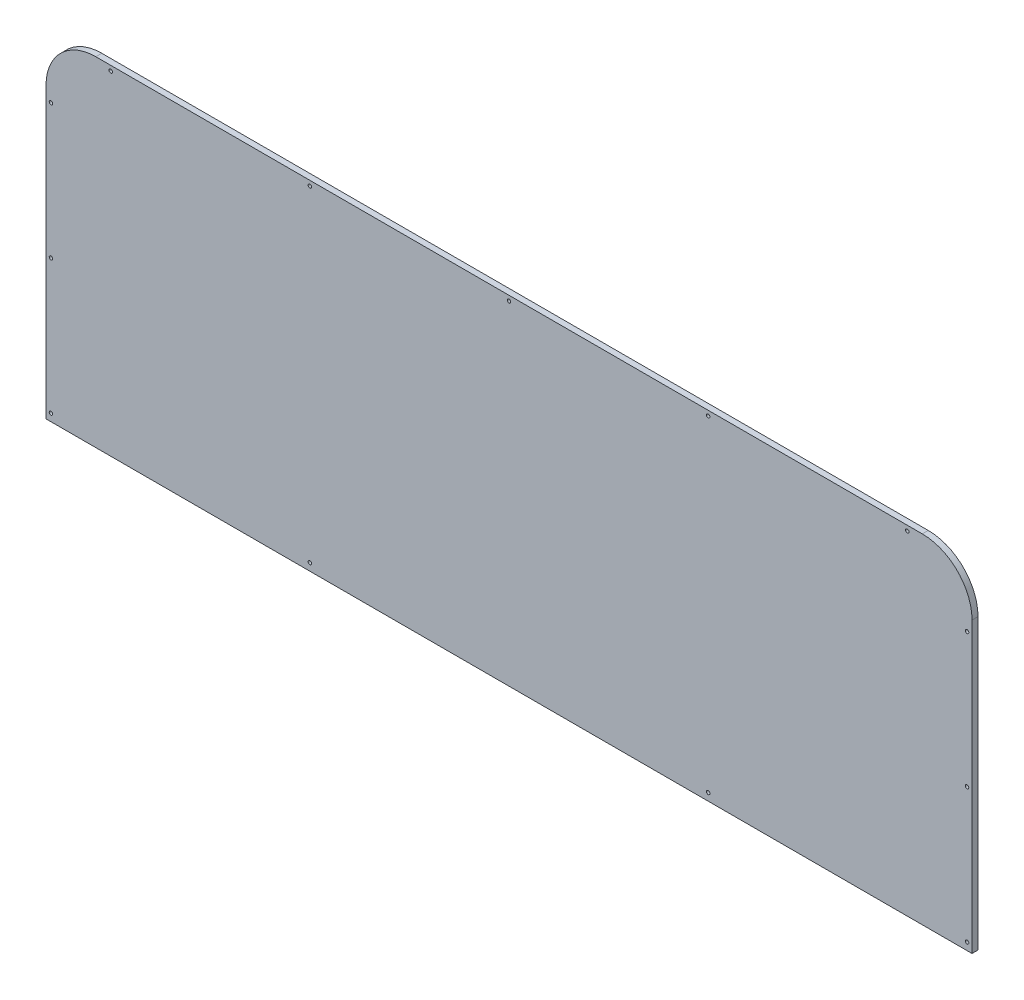
ISO-10303-21;
HEADER;
FILE_DESCRIPTION(('STEP AP214'),'2;1');
FILE_NAME('part.step','',(''),(''),'','','');
FILE_SCHEMA(('AUTOMOTIVE_DESIGN { 1 0 10303 214 1 1 1 1 }'));
ENDSEC;
DATA;
#1=APPLICATION_CONTEXT('core data for automotive mechanical design processes');
#2=APPLICATION_PROTOCOL_DEFINITION('international standard','automotive_design',2000,#1);
#3=PRODUCT_CONTEXT('',#1,'mechanical');
#4=PRODUCT('Part','Part','',(#3));
#5=PRODUCT_RELATED_PRODUCT_CATEGORY('part','',(#4));
#6=PRODUCT_DEFINITION_FORMATION('','',#4);
#7=PRODUCT_DEFINITION_CONTEXT('part definition',#1,'design');
#8=PRODUCT_DEFINITION('design','',#6,#7);
#9=PRODUCT_DEFINITION_SHAPE('','',#8);
#10=(LENGTH_UNIT() NAMED_UNIT(*) SI_UNIT(.MILLI.,.METRE.));
#11=(NAMED_UNIT(*) PLANE_ANGLE_UNIT() SI_UNIT($,.RADIAN.));
#12=(NAMED_UNIT(*) SI_UNIT($,.STERADIAN.) SOLID_ANGLE_UNIT());
#13=UNCERTAINTY_MEASURE_WITH_UNIT(LENGTH_MEASURE(1.E-05),#10,'distance_accuracy_value','');
#14=(GEOMETRIC_REPRESENTATION_CONTEXT(3) GLOBAL_UNCERTAINTY_ASSIGNED_CONTEXT((#13)) GLOBAL_UNIT_ASSIGNED_CONTEXT((#10,
#11,#12)) REPRESENTATION_CONTEXT('',''));
#15=CARTESIAN_POINT('',(0.,0.,0.));
#16=DIRECTION('',(0.,0.,1.));
#17=DIRECTION('',(1.,0.,0.));
#18=AXIS2_PLACEMENT_3D('',#15,#16,#17);
#19=CARTESIAN_POINT('',(830.,580.,-78.));
#20=DIRECTION('',(0.,0.,1.));
#21=DIRECTION('',(1.,0.,0.));
#22=AXIS2_PLACEMENT_3D('',#19,#20,#21);
#23=CYLINDRICAL_SURFACE('',#22,100.);
#24=CARTESIAN_POINT('',(830.,580.,-66.));
#25=DIRECTION('',(0.,0.,1.));
#26=DIRECTION('',(1.,0.,0.));
#27=AXIS2_PLACEMENT_3D('',#24,#25,#26);
#28=CIRCLE('',#27,100.);
#29=CARTESIAN_POINT('',(930.,579.999999999999,-66.));
#30=VERTEX_POINT('',#29);
#31=CARTESIAN_POINT('',(829.999999999999,680.,-66.));
#32=VERTEX_POINT('',#31);
#33=EDGE_CURVE('E120',#30,#32,#28,.T.);
#34=ORIENTED_EDGE('',*,*,#33,.F.);
#35=DIRECTION('',(0.,0.,1.));
#36=VECTOR('',#35,1.);
#37=CARTESIAN_POINT('',(930.,579.999999999999,-78.));
#38=LINE('',#37,#36);
#39=CARTESIAN_POINT('',(930.,579.999999999999,-78.));
#40=VERTEX_POINT('',#39);
#41=EDGE_CURVE('E40',#40,#30,#38,.T.);
#42=ORIENTED_EDGE('',*,*,#41,.F.);
#43=CARTESIAN_POINT('',(830.,580.,-78.));
#44=DIRECTION('',(0.,0.,1.));
#45=DIRECTION('',(1.,0.,0.));
#46=AXIS2_PLACEMENT_3D('',#43,#44,#45);
#47=CIRCLE('',#46,100.);
#48=CARTESIAN_POINT('',(829.999999999999,680.,-78.));
#49=VERTEX_POINT('',#48);
#50=EDGE_CURVE('E132',#40,#49,#47,.T.);
#51=ORIENTED_EDGE('',*,*,#50,.T.);
#52=DIRECTION('',(0.,0.,1.));
#53=VECTOR('',#52,1.);
#54=CARTESIAN_POINT('',(829.999999999999,680.,-78.));
#55=LINE('',#54,#53);
#56=EDGE_CURVE('E83',#49,#32,#55,.T.);
#57=ORIENTED_EDGE('',*,*,#56,.T.);
#58=EDGE_LOOP('',(#34,#42,#51,#57));
#59=FACE_BOUND('',#58,.T.);
#60=ADVANCED_FACE('F32',(#59),#23,.T.);
#61=CARTESIAN_POINT('',(930.,579.999999999999,-78.));
#62=DIRECTION('',(1.,0.,0.));
#63=DIRECTION('',(0.,0.,-1.));
#64=AXIS2_PLACEMENT_3D('',#61,#62,#63);
#65=PLANE('',#64);
#66=DIRECTION('',(0.,0.,-1.));
#67=VECTOR('',#66,1.);
#68=CARTESIAN_POINT('',(930.,0.,1000.));
#69=LINE('',#68,#67);
#70=CARTESIAN_POINT('',(930.,0.,-66.));
#71=VERTEX_POINT('',#70);
#72=CARTESIAN_POINT('',(930.,0.,-78.));
#73=VERTEX_POINT('',#72);
#74=EDGE_CURVE('E47',#71,#73,#69,.T.);
#75=ORIENTED_EDGE('',*,*,#74,.T.);
#76=DIRECTION('',(0.,1.,0.));
#77=VECTOR('',#76,1.);
#78=CARTESIAN_POINT('',(930.,579.999999999999,-78.));
#79=LINE('',#78,#77);
#80=EDGE_CURVE('E55',#73,#40,#79,.T.);
#81=ORIENTED_EDGE('',*,*,#80,.T.);
#82=ORIENTED_EDGE('',*,*,#41,.T.);
#83=DIRECTION('',(0.,1.,0.));
#84=VECTOR('',#83,1.);
#85=CARTESIAN_POINT('',(930.,579.999999999999,-66.));
#86=LINE('',#85,#84);
#87=EDGE_CURVE('E77',#71,#30,#86,.T.);
#88=ORIENTED_EDGE('',*,*,#87,.F.);
#89=EDGE_LOOP('',(#75,#81,#82,#88));
#90=FACE_BOUND('',#89,.T.);
#91=ADVANCED_FACE('F254',(#90),#65,.T.);
#92=CARTESIAN_POINT('',(-930.,-29.0000000000002,-78.));
#93=DIRECTION('',(-1.,0.,0.));
#94=DIRECTION('',(0.,0.,1.));
#95=AXIS2_PLACEMENT_3D('',#92,#93,#94);
#96=PLANE('',#95);
#97=DIRECTION('',(0.,0.,-1.));
#98=VECTOR('',#97,1.);
#99=CARTESIAN_POINT('',(-930.,0.,1000.));
#100=LINE('',#99,#98);
#101=CARTESIAN_POINT('',(-930.,0.,-66.0000000000001));
#102=VERTEX_POINT('',#101);
#103=CARTESIAN_POINT('',(-930.,0.,-78.));
#104=VERTEX_POINT('',#103);
#105=EDGE_CURVE('E93',#102,#104,#100,.T.);
#106=ORIENTED_EDGE('',*,*,#105,.F.);
#107=DIRECTION('',(0.,-1.,0.));
#108=VECTOR('',#107,1.);
#109=CARTESIAN_POINT('',(-930.,-29.0000000000002,-66.));
#110=LINE('',#109,#108);
#111=CARTESIAN_POINT('',(-930.,579.999999999999,-66.));
#112=VERTEX_POINT('',#111);
#113=EDGE_CURVE('E129',#112,#102,#110,.T.);
#114=ORIENTED_EDGE('',*,*,#113,.F.);
#115=DIRECTION('',(0.,0.,1.));
#116=VECTOR('',#115,1.);
#117=CARTESIAN_POINT('',(-930.,579.999999999999,-78.));
#118=LINE('',#117,#116);
#119=CARTESIAN_POINT('',(-930.,579.999999999999,-78.));
#120=VERTEX_POINT('',#119);
#121=EDGE_CURVE('E112',#120,#112,#118,.T.);
#122=ORIENTED_EDGE('',*,*,#121,.F.);
#123=DIRECTION('',(0.,-1.,0.));
#124=VECTOR('',#123,1.);
#125=CARTESIAN_POINT('',(-930.,-29.0000000000002,-78.));
#126=LINE('',#125,#124);
#127=EDGE_CURVE('E106',#120,#104,#126,.T.);
#128=ORIENTED_EDGE('',*,*,#127,.T.);
#129=EDGE_LOOP('',(#106,#114,#122,#128));
#130=FACE_BOUND('',#129,.T.);
#131=ADVANCED_FACE('F111',(#130),#96,.T.);
#132=CARTESIAN_POINT('',(-830.,580.,-78.));
#133=DIRECTION('',(0.,0.,1.));
#134=DIRECTION('',(1.,0.,0.));
#135=AXIS2_PLACEMENT_3D('',#132,#133,#134);
#136=CYLINDRICAL_SURFACE('',#135,100.);
#137=CARTESIAN_POINT('',(-830.,580.,-66.));
#138=DIRECTION('',(0.,0.,1.));
#139=DIRECTION('',(1.,0.,0.));
#140=AXIS2_PLACEMENT_3D('',#137,#138,#139);
#141=CIRCLE('',#140,100.);
#142=CARTESIAN_POINT('',(-829.999999999999,680.,-66.));
#143=VERTEX_POINT('',#142);
#144=EDGE_CURVE('E126',#143,#112,#141,.T.);
#145=ORIENTED_EDGE('',*,*,#144,.F.);
#146=DIRECTION('',(0.,0.,1.));
#147=VECTOR('',#146,1.);
#148=CARTESIAN_POINT('',(-829.999999999999,680.,-78.));
#149=LINE('',#148,#147);
#150=CARTESIAN_POINT('',(-829.999999999999,680.,-78.));
#151=VERTEX_POINT('',#150);
#152=EDGE_CURVE('E135',#151,#143,#149,.T.);
#153=ORIENTED_EDGE('',*,*,#152,.F.);
#154=CARTESIAN_POINT('',(-830.,580.,-78.));
#155=DIRECTION('',(0.,0.,1.));
#156=DIRECTION('',(1.,0.,0.));
#157=AXIS2_PLACEMENT_3D('',#154,#155,#156);
#158=CIRCLE('',#157,100.);
#159=EDGE_CURVE('E113',#151,#120,#158,.T.);
#160=ORIENTED_EDGE('',*,*,#159,.T.);
#161=ORIENTED_EDGE('',*,*,#121,.T.);
#162=EDGE_LOOP('',(#145,#153,#160,#161));
#163=FACE_BOUND('',#162,.T.);
#164=ADVANCED_FACE('F261',(#163),#136,.T.);
#165=CARTESIAN_POINT('',(-829.999999999999,680.,-78.));
#166=DIRECTION('',(0.,1.,0.));
#167=DIRECTION('',(0.,0.,1.));
#168=AXIS2_PLACEMENT_3D('',#165,#166,#167);
#169=PLANE('',#168);
#170=DIRECTION('',(-1.,0.,0.));
#171=VECTOR('',#170,1.);
#172=CARTESIAN_POINT('',(-829.999999999999,680.,-66.));
#173=LINE('',#172,#171);
#174=EDGE_CURVE('E122',#32,#143,#173,.T.);
#175=ORIENTED_EDGE('',*,*,#174,.F.);
#176=ORIENTED_EDGE('',*,*,#56,.F.);
#177=DIRECTION('',(-1.,0.,0.));
#178=VECTOR('',#177,1.);
#179=CARTESIAN_POINT('',(-829.999999999999,680.,-78.));
#180=LINE('',#179,#178);
#181=EDGE_CURVE('E116',#49,#151,#180,.T.);
#182=ORIENTED_EDGE('',*,*,#181,.T.);
#183=ORIENTED_EDGE('',*,*,#152,.T.);
#184=EDGE_LOOP('',(#175,#176,#182,#183));
#185=FACE_BOUND('',#184,.T.);
#186=ADVANCED_FACE('F250',(#185),#169,.T.);
#187=CARTESIAN_POINT('',(830.,580.,-78.));
#188=DIRECTION('',(0.,0.,1.));
#189=DIRECTION('',(1.,0.,0.));
#190=AXIS2_PLACEMENT_3D('',#187,#188,#189);
#191=PLANE('',#190);
#192=CARTESIAN_POINT('',(400.,15.,-78.));
#193=DIRECTION('',(0.,0.,-1.));
#194=DIRECTION('',(-1.,0.,0.));
#195=AXIS2_PLACEMENT_3D('',#192,#193,#194);
#196=CIRCLE('',#195,7.00000000000001);
#197=CARTESIAN_POINT('',(393.,15.,-78.));
#198=VERTEX_POINT('',#197);
#199=EDGE_CURVE('E392',#198,#198,#196,.T.);
#200=ORIENTED_EDGE('',*,*,#199,.F.);
#201=EDGE_LOOP('',(#200));
#202=FACE_BOUND('',#201,.T.);
#203=CARTESIAN_POINT('',(-400.,15.,-78.));
#204=DIRECTION('',(0.,0.,-1.));
#205=DIRECTION('',(-1.,0.,0.));
#206=AXIS2_PLACEMENT_3D('',#203,#204,#205);
#207=CIRCLE('',#206,7.00000000000001);
#208=CARTESIAN_POINT('',(-407.,15.,-78.));
#209=VERTEX_POINT('',#208);
#210=EDGE_CURVE('E195',#209,#209,#207,.T.);
#211=ORIENTED_EDGE('',*,*,#210,.F.);
#212=EDGE_LOOP('',(#211));
#213=FACE_BOUND('',#212,.T.);
#214=CARTESIAN_POINT('',(-920.,15.,-78.));
#215=DIRECTION('',(0.,0.,-1.));
#216=DIRECTION('',(-1.,0.,0.));
#217=AXIS2_PLACEMENT_3D('',#214,#215,#216);
#218=CIRCLE('',#217,7.00000000000001);
#219=CARTESIAN_POINT('',(-927.,15.,-78.));
#220=VERTEX_POINT('',#219);
#221=EDGE_CURVE('E203',#220,#220,#218,.T.);
#222=ORIENTED_EDGE('',*,*,#221,.F.);
#223=EDGE_LOOP('',(#222));
#224=FACE_BOUND('',#223,.T.);
#225=CARTESIAN_POINT('',(-920.,285.,-78.));
#226=DIRECTION('',(0.,0.,-1.));
#227=DIRECTION('',(-1.,0.,0.));
#228=AXIS2_PLACEMENT_3D('',#225,#226,#227);
#229=CIRCLE('',#228,7.00000000000001);
#230=CARTESIAN_POINT('',(-927.,285.,-78.));
#231=VERTEX_POINT('',#230);
#232=EDGE_CURVE('E188',#231,#231,#229,.T.);
#233=ORIENTED_EDGE('',*,*,#232,.F.);
#234=EDGE_LOOP('',(#233));
#235=FACE_BOUND('',#234,.T.);
#236=CARTESIAN_POINT('',(-920.,555.,-78.));
#237=DIRECTION('',(0.,0.,-1.));
#238=DIRECTION('',(-1.,0.,0.));
#239=AXIS2_PLACEMENT_3D('',#236,#237,#238);
#240=CIRCLE('',#239,7.00000000000001);
#241=CARTESIAN_POINT('',(-927.,555.,-78.));
#242=VERTEX_POINT('',#241);
#243=EDGE_CURVE('E184',#242,#242,#240,.T.);
#244=ORIENTED_EDGE('',*,*,#243,.F.);
#245=EDGE_LOOP('',(#244));
#246=FACE_BOUND('',#245,.T.);
#247=CARTESIAN_POINT('',(-800.,670.,-78.));
#248=DIRECTION('',(0.,0.,-1.));
#249=DIRECTION('',(-1.,0.,0.));
#250=AXIS2_PLACEMENT_3D('',#247,#248,#249);
#251=CIRCLE('',#250,7.00000000000001);
#252=CARTESIAN_POINT('',(-807.,670.,-78.));
#253=VERTEX_POINT('',#252);
#254=EDGE_CURVE('E179',#253,#253,#251,.T.);
#255=ORIENTED_EDGE('',*,*,#254,.F.);
#256=EDGE_LOOP('',(#255));
#257=FACE_BOUND('',#256,.T.);
#258=CARTESIAN_POINT('',(-400.,670.,-78.));
#259=DIRECTION('',(0.,0.,-1.));
#260=DIRECTION('',(-1.,0.,0.));
#261=AXIS2_PLACEMENT_3D('',#258,#259,#260);
#262=CIRCLE('',#261,7.00000000000001);
#263=CARTESIAN_POINT('',(-407.,670.,-78.));
#264=VERTEX_POINT('',#263);
#265=EDGE_CURVE('E174',#264,#264,#262,.T.);
#266=ORIENTED_EDGE('',*,*,#265,.F.);
#267=EDGE_LOOP('',(#266));
#268=FACE_BOUND('',#267,.T.);
#269=CARTESIAN_POINT('',(0.,670.,-78.));
#270=DIRECTION('',(0.,0.,-1.));
#271=DIRECTION('',(-1.,0.,0.));
#272=AXIS2_PLACEMENT_3D('',#269,#270,#271);
#273=CIRCLE('',#272,7.);
#274=CARTESIAN_POINT('',(-7.,670.,-78.));
#275=VERTEX_POINT('',#274);
#276=EDGE_CURVE('E169',#275,#275,#273,.T.);
#277=ORIENTED_EDGE('',*,*,#276,.F.);
#278=EDGE_LOOP('',(#277));
#279=FACE_BOUND('',#278,.T.);
#280=CARTESIAN_POINT('',(400.,670.,-78.));
#281=DIRECTION('',(0.,0.,-1.));
#282=DIRECTION('',(-1.,0.,0.));
#283=AXIS2_PLACEMENT_3D('',#280,#281,#282);
#284=CIRCLE('',#283,7.00000000000001);
#285=CARTESIAN_POINT('',(393.,670.,-78.));
#286=VERTEX_POINT('',#285);
#287=EDGE_CURVE('E164',#286,#286,#284,.T.);
#288=ORIENTED_EDGE('',*,*,#287,.F.);
#289=EDGE_LOOP('',(#288));
#290=FACE_BOUND('',#289,.T.);
#291=CARTESIAN_POINT('',(800.,670.,-78.));
#292=DIRECTION('',(0.,0.,-1.));
#293=DIRECTION('',(-1.,0.,0.));
#294=AXIS2_PLACEMENT_3D('',#291,#292,#293);
#295=CIRCLE('',#294,7.00000000000001);
#296=CARTESIAN_POINT('',(793.,670.,-78.));
#297=VERTEX_POINT('',#296);
#298=EDGE_CURVE('E159',#297,#297,#295,.T.);
#299=ORIENTED_EDGE('',*,*,#298,.F.);
#300=EDGE_LOOP('',(#299));
#301=FACE_BOUND('',#300,.T.);
#302=CARTESIAN_POINT('',(920.,555.,-78.));
#303=DIRECTION('',(0.,0.,-1.));
#304=DIRECTION('',(-1.,0.,0.));
#305=AXIS2_PLACEMENT_3D('',#302,#303,#304);
#306=CIRCLE('',#305,7.00000000000001);
#307=CARTESIAN_POINT('',(913.,555.,-78.));
#308=VERTEX_POINT('',#307);
#309=EDGE_CURVE('E154',#308,#308,#306,.T.);
#310=ORIENTED_EDGE('',*,*,#309,.F.);
#311=EDGE_LOOP('',(#310));
#312=FACE_BOUND('',#311,.T.);
#313=CARTESIAN_POINT('',(920.,285.,-78.));
#314=DIRECTION('',(0.,0.,-1.));
#315=DIRECTION('',(-1.,0.,0.));
#316=AXIS2_PLACEMENT_3D('',#313,#314,#315);
#317=CIRCLE('',#316,7.00000000000001);
#318=CARTESIAN_POINT('',(913.,285.,-78.));
#319=VERTEX_POINT('',#318);
#320=EDGE_CURVE('E149',#319,#319,#317,.T.);
#321=ORIENTED_EDGE('',*,*,#320,.F.);
#322=EDGE_LOOP('',(#321));
#323=FACE_BOUND('',#322,.T.);
#324=CARTESIAN_POINT('',(920.,14.9999999999998,-78.));
#325=DIRECTION('',(0.,0.,-1.));
#326=DIRECTION('',(-1.,0.,0.));
#327=AXIS2_PLACEMENT_3D('',#324,#325,#326);
#328=CIRCLE('',#327,7.00000000000001);
#329=CARTESIAN_POINT('',(913.,14.9999999999998,-78.));
#330=VERTEX_POINT('',#329);
#331=EDGE_CURVE('E144',#330,#330,#328,.T.);
#332=ORIENTED_EDGE('',*,*,#331,.F.);
#333=EDGE_LOOP('',(#332));
#334=FACE_BOUND('',#333,.T.);
#335=ORIENTED_EDGE('',*,*,#80,.F.);
#336=DIRECTION('',(1.,0.,0.));
#337=VECTOR('',#336,1.);
#338=CARTESIAN_POINT('',(930.,0.,-78.));
#339=LINE('',#338,#337);
#340=EDGE_CURVE('E96',#104,#73,#339,.T.);
#341=ORIENTED_EDGE('',*,*,#340,.F.);
#342=ORIENTED_EDGE('',*,*,#127,.F.);
#343=ORIENTED_EDGE('',*,*,#159,.F.);
#344=ORIENTED_EDGE('',*,*,#181,.F.);
#345=ORIENTED_EDGE('',*,*,#50,.F.);
#346=EDGE_LOOP('',(#335,#341,#342,#343,#344,#345));
#347=FACE_BOUND('',#346,.T.);
#348=ADVANCED_FACE('F104',(#202,#213,#224,#235,#246,#257,#268,#279,#290,#301,#312,#323,#334,
#347),#191,.F.);
#349=CARTESIAN_POINT('',(830.,580.,-66.));
#350=DIRECTION('',(0.,0.,1.));
#351=DIRECTION('',(1.,0.,0.));
#352=AXIS2_PLACEMENT_3D('',#349,#350,#351);
#353=PLANE('',#352);
#354=CARTESIAN_POINT('',(400.,15.,-66.));
#355=DIRECTION('',(0.,0.,1.));
#356=DIRECTION('',(1.,0.,0.));
#357=AXIS2_PLACEMENT_3D('',#354,#355,#356);
#358=CIRCLE('',#357,3.49999999999986);
#359=CARTESIAN_POINT('',(403.5,15.,-66.));
#360=VERTEX_POINT('',#359);
#361=EDGE_CURVE('E35',#360,#360,#358,.T.);
#362=ORIENTED_EDGE('',*,*,#361,.F.);
#363=EDGE_LOOP('',(#362));
#364=FACE_BOUND('',#363,.T.);
#365=CARTESIAN_POINT('',(-400.,15.,-66.));
#366=DIRECTION('',(0.,0.,1.));
#367=DIRECTION('',(1.,0.,0.));
#368=AXIS2_PLACEMENT_3D('',#365,#366,#367);
#369=CIRCLE('',#368,3.49999999999986);
#370=CARTESIAN_POINT('',(-396.5,15.,-66.));
#371=VERTEX_POINT('',#370);
#372=EDGE_CURVE('E109',#371,#371,#369,.T.);
#373=ORIENTED_EDGE('',*,*,#372,.F.);
#374=EDGE_LOOP('',(#373));
#375=FACE_BOUND('',#374,.T.);
#376=DIRECTION('',(-1.,0.,0.));
#377=VECTOR('',#376,1.);
#378=CARTESIAN_POINT('',(830.,0.,-66.));
#379=LINE('',#378,#377);
#380=EDGE_CURVE('E11',#71,#102,#379,.T.);
#381=ORIENTED_EDGE('',*,*,#380,.F.);
#382=ORIENTED_EDGE('',*,*,#87,.T.);
#383=ORIENTED_EDGE('',*,*,#33,.T.);
#384=ORIENTED_EDGE('',*,*,#174,.T.);
#385=ORIENTED_EDGE('',*,*,#144,.T.);
#386=ORIENTED_EDGE('',*,*,#113,.T.);
#387=EDGE_LOOP('',(#381,#382,#383,#384,#385,#386));
#388=FACE_BOUND('',#387,.T.);
#389=CARTESIAN_POINT('',(-920.,15.,-66.));
#390=DIRECTION('',(0.,0.,1.));
#391=DIRECTION('',(1.,0.,0.));
#392=AXIS2_PLACEMENT_3D('',#389,#390,#391);
#393=CIRCLE('',#392,3.49999999999984);
#394=CARTESIAN_POINT('',(-916.5,15.,-66.));
#395=VERTEX_POINT('',#394);
#396=EDGE_CURVE('E186',#395,#395,#393,.T.);
#397=ORIENTED_EDGE('',*,*,#396,.F.);
#398=EDGE_LOOP('',(#397));
#399=FACE_BOUND('',#398,.T.);
#400=CARTESIAN_POINT('',(-920.,285.,-66.));
#401=DIRECTION('',(0.,0.,1.));
#402=DIRECTION('',(1.,0.,0.));
#403=AXIS2_PLACEMENT_3D('',#400,#401,#402);
#404=CIRCLE('',#403,3.49999999999984);
#405=CARTESIAN_POINT('',(-916.5,285.,-66.));
#406=VERTEX_POINT('',#405);
#407=EDGE_CURVE('E181',#406,#406,#404,.T.);
#408=ORIENTED_EDGE('',*,*,#407,.F.);
#409=EDGE_LOOP('',(#408));
#410=FACE_BOUND('',#409,.T.);
#411=CARTESIAN_POINT('',(-920.,555.,-66.));
#412=DIRECTION('',(0.,0.,1.));
#413=DIRECTION('',(1.,0.,0.));
#414=AXIS2_PLACEMENT_3D('',#411,#412,#413);
#415=CIRCLE('',#414,3.49999999999984);
#416=CARTESIAN_POINT('',(-916.5,555.,-66.));
#417=VERTEX_POINT('',#416);
#418=EDGE_CURVE('E176',#417,#417,#415,.T.);
#419=ORIENTED_EDGE('',*,*,#418,.F.);
#420=EDGE_LOOP('',(#419));
#421=FACE_BOUND('',#420,.T.);
#422=CARTESIAN_POINT('',(-800.,670.,-66.));
#423=DIRECTION('',(0.,0.,1.));
#424=DIRECTION('',(1.,0.,0.));
#425=AXIS2_PLACEMENT_3D('',#422,#423,#424);
#426=CIRCLE('',#425,3.49999999999984);
#427=CARTESIAN_POINT('',(-796.5,670.,-66.));
#428=VERTEX_POINT('',#427);
#429=EDGE_CURVE('E171',#428,#428,#426,.T.);
#430=ORIENTED_EDGE('',*,*,#429,.F.);
#431=EDGE_LOOP('',(#430));
#432=FACE_BOUND('',#431,.T.);
#433=CARTESIAN_POINT('',(-400.,670.,-66.));
#434=DIRECTION('',(0.,0.,1.));
#435=DIRECTION('',(1.,0.,0.));
#436=AXIS2_PLACEMENT_3D('',#433,#434,#435);
#437=CIRCLE('',#436,3.49999999999986);
#438=CARTESIAN_POINT('',(-396.5,670.,-66.));
#439=VERTEX_POINT('',#438);
#440=EDGE_CURVE('E166',#439,#439,#437,.T.);
#441=ORIENTED_EDGE('',*,*,#440,.F.);
#442=EDGE_LOOP('',(#441));
#443=FACE_BOUND('',#442,.T.);
#444=CARTESIAN_POINT('',(0.,670.,-66.));
#445=DIRECTION('',(0.,0.,1.));
#446=DIRECTION('',(1.,0.,0.));
#447=AXIS2_PLACEMENT_3D('',#444,#445,#446);
#448=CIRCLE('',#447,3.49999999999986);
#449=CARTESIAN_POINT('',(3.49999999999986,670.,-66.));
#450=VERTEX_POINT('',#449);
#451=EDGE_CURVE('E161',#450,#450,#448,.T.);
#452=ORIENTED_EDGE('',*,*,#451,.F.);
#453=EDGE_LOOP('',(#452));
#454=FACE_BOUND('',#453,.T.);
#455=CARTESIAN_POINT('',(400.,670.,-66.));
#456=DIRECTION('',(0.,0.,1.));
#457=DIRECTION('',(1.,0.,0.));
#458=AXIS2_PLACEMENT_3D('',#455,#456,#457);
#459=CIRCLE('',#458,3.49999999999986);
#460=CARTESIAN_POINT('',(403.5,670.,-66.));
#461=VERTEX_POINT('',#460);
#462=EDGE_CURVE('E156',#461,#461,#459,.T.);
#463=ORIENTED_EDGE('',*,*,#462,.F.);
#464=EDGE_LOOP('',(#463));
#465=FACE_BOUND('',#464,.T.);
#466=CARTESIAN_POINT('',(800.,670.,-66.));
#467=DIRECTION('',(0.,0.,1.));
#468=DIRECTION('',(1.,0.,0.));
#469=AXIS2_PLACEMENT_3D('',#466,#467,#468);
#470=CIRCLE('',#469,3.49999999999984);
#471=CARTESIAN_POINT('',(803.5,670.,-66.));
#472=VERTEX_POINT('',#471);
#473=EDGE_CURVE('E151',#472,#472,#470,.T.);
#474=ORIENTED_EDGE('',*,*,#473,.F.);
#475=EDGE_LOOP('',(#474));
#476=FACE_BOUND('',#475,.T.);
#477=CARTESIAN_POINT('',(920.,555.,-66.));
#478=DIRECTION('',(0.,0.,1.));
#479=DIRECTION('',(1.,0.,0.));
#480=AXIS2_PLACEMENT_3D('',#477,#478,#479);
#481=CIRCLE('',#480,3.49999999999984);
#482=CARTESIAN_POINT('',(923.5,555.,-66.));
#483=VERTEX_POINT('',#482);
#484=EDGE_CURVE('E146',#483,#483,#481,.T.);
#485=ORIENTED_EDGE('',*,*,#484,.F.);
#486=EDGE_LOOP('',(#485));
#487=FACE_BOUND('',#486,.T.);
#488=CARTESIAN_POINT('',(920.,285.,-66.));
#489=DIRECTION('',(0.,0.,1.));
#490=DIRECTION('',(1.,0.,0.));
#491=AXIS2_PLACEMENT_3D('',#488,#489,#490);
#492=CIRCLE('',#491,3.49999999999984);
#493=CARTESIAN_POINT('',(923.5,285.,-66.));
#494=VERTEX_POINT('',#493);
#495=EDGE_CURVE('E141',#494,#494,#492,.T.);
#496=ORIENTED_EDGE('',*,*,#495,.F.);
#497=EDGE_LOOP('',(#496));
#498=FACE_BOUND('',#497,.T.);
#499=CARTESIAN_POINT('',(920.,14.9999999999998,-66.));
#500=DIRECTION('',(0.,0.,1.));
#501=DIRECTION('',(1.,0.,0.));
#502=AXIS2_PLACEMENT_3D('',#499,#500,#501);
#503=CIRCLE('',#502,3.49999999999984);
#504=CARTESIAN_POINT('',(923.5,14.9999999999998,-66.));
#505=VERTEX_POINT('',#504);
#506=EDGE_CURVE('E123',#505,#505,#503,.T.);
#507=ORIENTED_EDGE('',*,*,#506,.F.);
#508=EDGE_LOOP('',(#507));
#509=FACE_BOUND('',#508,.T.);
#510=ADVANCED_FACE('F264',(#364,#375,#388,#399,#410,#421,#432,#443,#454,#465,#476,#487,#498,
#509),#353,.T.);
#511=CARTESIAN_POINT('',(920.,14.9999999999998,-78.));
#512=DIRECTION('',(0.,0.,-1.));
#513=DIRECTION('',(-1.,0.,0.));
#514=AXIS2_PLACEMENT_3D('',#511,#512,#513);
#515=CYLINDRICAL_SURFACE('',#514,3.49999999999984);
#516=ORIENTED_EDGE('',*,*,#506,.T.);
#517=EDGE_LOOP('',(#516));
#518=FACE_BOUND('',#517,.T.);
#519=CARTESIAN_POINT('',(920.,14.9999999999998,-74.5000000000002));
#520=DIRECTION('',(0.,0.,-1.));
#521=DIRECTION('',(-1.,0.,0.));
#522=AXIS2_PLACEMENT_3D('',#519,#520,#521);
#523=CIRCLE('',#522,3.49999999999984);
#524=CARTESIAN_POINT('',(916.5,14.9999999999998,-74.5000000000002));
#525=VERTEX_POINT('',#524);
#526=EDGE_CURVE('E140',#525,#525,#523,.T.);
#527=ORIENTED_EDGE('',*,*,#526,.T.);
#528=EDGE_LOOP('',(#527));
#529=FACE_BOUND('',#528,.T.);
#530=ADVANCED_FACE('F277',(#518,#529),#515,.F.);
#531=CARTESIAN_POINT('',(920.,14.9999999999998,-78.));
#532=DIRECTION('',(0.,0.,-1.));
#533=DIRECTION('',(-1.,0.,0.));
#534=AXIS2_PLACEMENT_3D('',#531,#532,#533);
#535=CONICAL_SURFACE('',#534,7.00000000000001,0.785398163397496);
#536=ORIENTED_EDGE('',*,*,#526,.F.);
#537=EDGE_LOOP('',(#536));
#538=FACE_BOUND('',#537,.T.);
#539=ORIENTED_EDGE('',*,*,#331,.T.);
#540=EDGE_LOOP('',(#539));
#541=FACE_BOUND('',#540,.T.);
#542=ADVANCED_FACE('F284',(#538,#541),#535,.F.);
#543=CARTESIAN_POINT('',(920.,285.,-78.));
#544=DIRECTION('',(0.,0.,-1.));
#545=DIRECTION('',(-1.,0.,0.));
#546=AXIS2_PLACEMENT_3D('',#543,#544,#545);
#547=CYLINDRICAL_SURFACE('',#546,3.49999999999984);
#548=ORIENTED_EDGE('',*,*,#495,.T.);
#549=EDGE_LOOP('',(#548));
#550=FACE_BOUND('',#549,.T.);
#551=CARTESIAN_POINT('',(920.,285.,-74.5000000000002));
#552=DIRECTION('',(0.,0.,-1.));
#553=DIRECTION('',(-1.,0.,0.));
#554=AXIS2_PLACEMENT_3D('',#551,#552,#553);
#555=CIRCLE('',#554,3.49999999999984);
#556=CARTESIAN_POINT('',(916.5,285.,-74.5000000000002));
#557=VERTEX_POINT('',#556);
#558=EDGE_CURVE('E145',#557,#557,#555,.T.);
#559=ORIENTED_EDGE('',*,*,#558,.T.);
#560=EDGE_LOOP('',(#559));
#561=FACE_BOUND('',#560,.T.);
#562=ADVANCED_FACE('F288',(#550,#561),#547,.F.);
#563=CARTESIAN_POINT('',(920.,285.,-78.));
#564=DIRECTION('',(0.,0.,-1.));
#565=DIRECTION('',(-1.,0.,0.));
#566=AXIS2_PLACEMENT_3D('',#563,#564,#565);
#567=CONICAL_SURFACE('',#566,7.00000000000001,0.785398163397496);
#568=ORIENTED_EDGE('',*,*,#558,.F.);
#569=EDGE_LOOP('',(#568));
#570=FACE_BOUND('',#569,.T.);
#571=ORIENTED_EDGE('',*,*,#320,.T.);
#572=EDGE_LOOP('',(#571));
#573=FACE_BOUND('',#572,.T.);
#574=ADVANCED_FACE('F292',(#570,#573),#567,.F.);
#575=CARTESIAN_POINT('',(920.,555.,-78.));
#576=DIRECTION('',(0.,0.,-1.));
#577=DIRECTION('',(-1.,0.,0.));
#578=AXIS2_PLACEMENT_3D('',#575,#576,#577);
#579=CYLINDRICAL_SURFACE('',#578,3.49999999999984);
#580=ORIENTED_EDGE('',*,*,#484,.T.);
#581=EDGE_LOOP('',(#580));
#582=FACE_BOUND('',#581,.T.);
#583=CARTESIAN_POINT('',(920.,555.,-74.5000000000002));
#584=DIRECTION('',(0.,0.,-1.));
#585=DIRECTION('',(-1.,0.,0.));
#586=AXIS2_PLACEMENT_3D('',#583,#584,#585);
#587=CIRCLE('',#586,3.49999999999984);
#588=CARTESIAN_POINT('',(916.5,555.,-74.5000000000002));
#589=VERTEX_POINT('',#588);
#590=EDGE_CURVE('E150',#589,#589,#587,.T.);
#591=ORIENTED_EDGE('',*,*,#590,.T.);
#592=EDGE_LOOP('',(#591));
#593=FACE_BOUND('',#592,.T.);
#594=ADVANCED_FACE('F296',(#582,#593),#579,.F.);
#595=CARTESIAN_POINT('',(920.,555.,-78.));
#596=DIRECTION('',(0.,0.,-1.));
#597=DIRECTION('',(-1.,0.,0.));
#598=AXIS2_PLACEMENT_3D('',#595,#596,#597);
#599=CONICAL_SURFACE('',#598,7.00000000000001,0.785398163397496);
#600=ORIENTED_EDGE('',*,*,#590,.F.);
#601=EDGE_LOOP('',(#600));
#602=FACE_BOUND('',#601,.T.);
#603=ORIENTED_EDGE('',*,*,#309,.T.);
#604=EDGE_LOOP('',(#603));
#605=FACE_BOUND('',#604,.T.);
#606=ADVANCED_FACE('F300',(#602,#605),#599,.F.);
#607=CARTESIAN_POINT('',(800.,670.,-78.));
#608=DIRECTION('',(0.,0.,-1.));
#609=DIRECTION('',(-1.,0.,0.));
#610=AXIS2_PLACEMENT_3D('',#607,#608,#609);
#611=CYLINDRICAL_SURFACE('',#610,3.49999999999984);
#612=ORIENTED_EDGE('',*,*,#473,.T.);
#613=EDGE_LOOP('',(#612));
#614=FACE_BOUND('',#613,.T.);
#615=CARTESIAN_POINT('',(800.,670.,-74.5000000000002));
#616=DIRECTION('',(0.,0.,-1.));
#617=DIRECTION('',(-1.,0.,0.));
#618=AXIS2_PLACEMENT_3D('',#615,#616,#617);
#619=CIRCLE('',#618,3.49999999999984);
#620=CARTESIAN_POINT('',(796.5,670.,-74.5000000000002));
#621=VERTEX_POINT('',#620);
#622=EDGE_CURVE('E155',#621,#621,#619,.T.);
#623=ORIENTED_EDGE('',*,*,#622,.T.);
#624=EDGE_LOOP('',(#623));
#625=FACE_BOUND('',#624,.T.);
#626=ADVANCED_FACE('F304',(#614,#625),#611,.F.);
#627=CARTESIAN_POINT('',(800.,670.,-78.));
#628=DIRECTION('',(0.,0.,-1.));
#629=DIRECTION('',(-1.,0.,0.));
#630=AXIS2_PLACEMENT_3D('',#627,#628,#629);
#631=CONICAL_SURFACE('',#630,7.00000000000001,0.785398163397496);
#632=ORIENTED_EDGE('',*,*,#622,.F.);
#633=EDGE_LOOP('',(#632));
#634=FACE_BOUND('',#633,.T.);
#635=ORIENTED_EDGE('',*,*,#298,.T.);
#636=EDGE_LOOP('',(#635));
#637=FACE_BOUND('',#636,.T.);
#638=ADVANCED_FACE('F308',(#634,#637),#631,.F.);
#639=CARTESIAN_POINT('',(400.,670.,-78.));
#640=DIRECTION('',(0.,0.,-1.));
#641=DIRECTION('',(-1.,0.,0.));
#642=AXIS2_PLACEMENT_3D('',#639,#640,#641);
#643=CYLINDRICAL_SURFACE('',#642,3.49999999999986);
#644=ORIENTED_EDGE('',*,*,#462,.T.);
#645=EDGE_LOOP('',(#644));
#646=FACE_BOUND('',#645,.T.);
#647=CARTESIAN_POINT('',(400.,670.,-74.5000000000002));
#648=DIRECTION('',(0.,0.,-1.));
#649=DIRECTION('',(-1.,0.,0.));
#650=AXIS2_PLACEMENT_3D('',#647,#648,#649);
#651=CIRCLE('',#650,3.49999999999989);
#652=CARTESIAN_POINT('',(396.5,670.,-74.5000000000002));
#653=VERTEX_POINT('',#652);
#654=EDGE_CURVE('E160',#653,#653,#651,.T.);
#655=ORIENTED_EDGE('',*,*,#654,.T.);
#656=EDGE_LOOP('',(#655));
#657=FACE_BOUND('',#656,.T.);
#658=ADVANCED_FACE('F312',(#646,#657),#643,.F.);
#659=CARTESIAN_POINT('',(400.,670.,-78.));
#660=DIRECTION('',(0.,0.,-1.));
#661=DIRECTION('',(-1.,0.,0.));
#662=AXIS2_PLACEMENT_3D('',#659,#660,#661);
#663=CONICAL_SURFACE('',#662,7.00000000000001,0.785398163397488);
#664=ORIENTED_EDGE('',*,*,#654,.F.);
#665=EDGE_LOOP('',(#664));
#666=FACE_BOUND('',#665,.T.);
#667=ORIENTED_EDGE('',*,*,#287,.T.);
#668=EDGE_LOOP('',(#667));
#669=FACE_BOUND('',#668,.T.);
#670=ADVANCED_FACE('F316',(#666,#669),#663,.F.);
#671=CARTESIAN_POINT('',(0.,670.,-78.));
#672=DIRECTION('',(0.,0.,-1.));
#673=DIRECTION('',(-1.,0.,0.));
#674=AXIS2_PLACEMENT_3D('',#671,#672,#673);
#675=CYLINDRICAL_SURFACE('',#674,3.49999999999986);
#676=ORIENTED_EDGE('',*,*,#451,.T.);
#677=EDGE_LOOP('',(#676));
#678=FACE_BOUND('',#677,.T.);
#679=CARTESIAN_POINT('',(0.,670.,-74.5000000000002));
#680=DIRECTION('',(0.,0.,-1.));
#681=DIRECTION('',(-1.,0.,0.));
#682=AXIS2_PLACEMENT_3D('',#679,#680,#681);
#683=CIRCLE('',#682,3.49999999999987);
#684=CARTESIAN_POINT('',(-3.49999999999987,670.,-74.5000000000002));
#685=VERTEX_POINT('',#684);
#686=EDGE_CURVE('E165',#685,#685,#683,.T.);
#687=ORIENTED_EDGE('',*,*,#686,.T.);
#688=EDGE_LOOP('',(#687));
#689=FACE_BOUND('',#688,.T.);
#690=ADVANCED_FACE('F320',(#678,#689),#675,.F.);
#691=CARTESIAN_POINT('',(0.,670.,-78.));
#692=DIRECTION('',(0.,0.,-1.));
#693=DIRECTION('',(-1.,0.,0.));
#694=AXIS2_PLACEMENT_3D('',#691,#692,#693);
#695=CONICAL_SURFACE('',#694,7.,0.78539816339749);
#696=ORIENTED_EDGE('',*,*,#686,.F.);
#697=EDGE_LOOP('',(#696));
#698=FACE_BOUND('',#697,.T.);
#699=ORIENTED_EDGE('',*,*,#276,.T.);
#700=EDGE_LOOP('',(#699));
#701=FACE_BOUND('',#700,.T.);
#702=ADVANCED_FACE('F324',(#698,#701),#695,.F.);
#703=CARTESIAN_POINT('',(-400.,670.,-78.));
#704=DIRECTION('',(0.,0.,-1.));
#705=DIRECTION('',(-1.,0.,0.));
#706=AXIS2_PLACEMENT_3D('',#703,#704,#705);
#707=CYLINDRICAL_SURFACE('',#706,3.49999999999986);
#708=ORIENTED_EDGE('',*,*,#440,.T.);
#709=EDGE_LOOP('',(#708));
#710=FACE_BOUND('',#709,.T.);
#711=CARTESIAN_POINT('',(-400.,670.,-74.5000000000002));
#712=DIRECTION('',(0.,0.,-1.));
#713=DIRECTION('',(-1.,0.,0.));
#714=AXIS2_PLACEMENT_3D('',#711,#712,#713);
#715=CIRCLE('',#714,3.49999999999989);
#716=CARTESIAN_POINT('',(-403.5,670.,-74.5000000000002));
#717=VERTEX_POINT('',#716);
#718=EDGE_CURVE('E170',#717,#717,#715,.T.);
#719=ORIENTED_EDGE('',*,*,#718,.T.);
#720=EDGE_LOOP('',(#719));
#721=FACE_BOUND('',#720,.T.);
#722=ADVANCED_FACE('F328',(#710,#721),#707,.F.);
#723=CARTESIAN_POINT('',(-400.,670.,-78.));
#724=DIRECTION('',(0.,0.,-1.));
#725=DIRECTION('',(-1.,0.,0.));
#726=AXIS2_PLACEMENT_3D('',#723,#724,#725);
#727=CONICAL_SURFACE('',#726,7.00000000000001,0.785398163397488);
#728=ORIENTED_EDGE('',*,*,#718,.F.);
#729=EDGE_LOOP('',(#728));
#730=FACE_BOUND('',#729,.T.);
#731=ORIENTED_EDGE('',*,*,#265,.T.);
#732=EDGE_LOOP('',(#731));
#733=FACE_BOUND('',#732,.T.);
#734=ADVANCED_FACE('F332',(#730,#733),#727,.F.);
#735=CARTESIAN_POINT('',(-800.,670.,-78.));
#736=DIRECTION('',(0.,0.,-1.));
#737=DIRECTION('',(-1.,0.,0.));
#738=AXIS2_PLACEMENT_3D('',#735,#736,#737);
#739=CYLINDRICAL_SURFACE('',#738,3.49999999999984);
#740=ORIENTED_EDGE('',*,*,#429,.T.);
#741=EDGE_LOOP('',(#740));
#742=FACE_BOUND('',#741,.T.);
#743=CARTESIAN_POINT('',(-800.,670.,-74.5000000000002));
#744=DIRECTION('',(0.,0.,-1.));
#745=DIRECTION('',(-1.,0.,0.));
#746=AXIS2_PLACEMENT_3D('',#743,#744,#745);
#747=CIRCLE('',#746,3.49999999999984);
#748=CARTESIAN_POINT('',(-803.5,670.,-74.5000000000002));
#749=VERTEX_POINT('',#748);
#750=EDGE_CURVE('E175',#749,#749,#747,.T.);
#751=ORIENTED_EDGE('',*,*,#750,.T.);
#752=EDGE_LOOP('',(#751));
#753=FACE_BOUND('',#752,.T.);
#754=ADVANCED_FACE('F336',(#742,#753),#739,.F.);
#755=CARTESIAN_POINT('',(-800.,670.,-78.));
#756=DIRECTION('',(0.,0.,-1.));
#757=DIRECTION('',(-1.,0.,0.));
#758=AXIS2_PLACEMENT_3D('',#755,#756,#757);
#759=CONICAL_SURFACE('',#758,7.00000000000001,0.785398163397496);
#760=ORIENTED_EDGE('',*,*,#750,.F.);
#761=EDGE_LOOP('',(#760));
#762=FACE_BOUND('',#761,.T.);
#763=ORIENTED_EDGE('',*,*,#254,.T.);
#764=EDGE_LOOP('',(#763));
#765=FACE_BOUND('',#764,.T.);
#766=ADVANCED_FACE('F340',(#762,#765),#759,.F.);
#767=CARTESIAN_POINT('',(-920.,555.,-78.));
#768=DIRECTION('',(0.,0.,-1.));
#769=DIRECTION('',(-1.,0.,0.));
#770=AXIS2_PLACEMENT_3D('',#767,#768,#769);
#771=CYLINDRICAL_SURFACE('',#770,3.49999999999984);
#772=ORIENTED_EDGE('',*,*,#418,.T.);
#773=EDGE_LOOP('',(#772));
#774=FACE_BOUND('',#773,.T.);
#775=CARTESIAN_POINT('',(-920.,555.,-74.5000000000002));
#776=DIRECTION('',(0.,0.,-1.));
#777=DIRECTION('',(-1.,0.,0.));
#778=AXIS2_PLACEMENT_3D('',#775,#776,#777);
#779=CIRCLE('',#778,3.49999999999984);
#780=CARTESIAN_POINT('',(-923.5,555.,-74.5000000000002));
#781=VERTEX_POINT('',#780);
#782=EDGE_CURVE('E180',#781,#781,#779,.T.);
#783=ORIENTED_EDGE('',*,*,#782,.T.);
#784=EDGE_LOOP('',(#783));
#785=FACE_BOUND('',#784,.T.);
#786=ADVANCED_FACE('F344',(#774,#785),#771,.F.);
#787=CARTESIAN_POINT('',(-920.,555.,-78.));
#788=DIRECTION('',(0.,0.,-1.));
#789=DIRECTION('',(-1.,0.,0.));
#790=AXIS2_PLACEMENT_3D('',#787,#788,#789);
#791=CONICAL_SURFACE('',#790,7.00000000000001,0.785398163397496);
#792=ORIENTED_EDGE('',*,*,#782,.F.);
#793=EDGE_LOOP('',(#792));
#794=FACE_BOUND('',#793,.T.);
#795=ORIENTED_EDGE('',*,*,#243,.T.);
#796=EDGE_LOOP('',(#795));
#797=FACE_BOUND('',#796,.T.);
#798=ADVANCED_FACE('F348',(#794,#797),#791,.F.);
#799=CARTESIAN_POINT('',(-920.,285.,-78.));
#800=DIRECTION('',(0.,0.,-1.));
#801=DIRECTION('',(-1.,0.,0.));
#802=AXIS2_PLACEMENT_3D('',#799,#800,#801);
#803=CYLINDRICAL_SURFACE('',#802,3.49999999999984);
#804=ORIENTED_EDGE('',*,*,#407,.T.);
#805=EDGE_LOOP('',(#804));
#806=FACE_BOUND('',#805,.T.);
#807=CARTESIAN_POINT('',(-920.,285.,-74.5000000000002));
#808=DIRECTION('',(0.,0.,-1.));
#809=DIRECTION('',(-1.,0.,0.));
#810=AXIS2_PLACEMENT_3D('',#807,#808,#809);
#811=CIRCLE('',#810,3.49999999999984);
#812=CARTESIAN_POINT('',(-923.5,285.,-74.5000000000002));
#813=VERTEX_POINT('',#812);
#814=EDGE_CURVE('E185',#813,#813,#811,.T.);
#815=ORIENTED_EDGE('',*,*,#814,.T.);
#816=EDGE_LOOP('',(#815));
#817=FACE_BOUND('',#816,.T.);
#818=ADVANCED_FACE('F352',(#806,#817),#803,.F.);
#819=CARTESIAN_POINT('',(-920.,285.,-78.));
#820=DIRECTION('',(0.,0.,-1.));
#821=DIRECTION('',(-1.,0.,0.));
#822=AXIS2_PLACEMENT_3D('',#819,#820,#821);
#823=CONICAL_SURFACE('',#822,7.00000000000001,0.785398163397496);
#824=ORIENTED_EDGE('',*,*,#814,.F.);
#825=EDGE_LOOP('',(#824));
#826=FACE_BOUND('',#825,.T.);
#827=ORIENTED_EDGE('',*,*,#232,.T.);
#828=EDGE_LOOP('',(#827));
#829=FACE_BOUND('',#828,.T.);
#830=ADVANCED_FACE('F356',(#826,#829),#823,.F.);
#831=CARTESIAN_POINT('',(-920.,15.,-78.));
#832=DIRECTION('',(0.,0.,-1.));
#833=DIRECTION('',(-1.,0.,0.));
#834=AXIS2_PLACEMENT_3D('',#831,#832,#833);
#835=CYLINDRICAL_SURFACE('',#834,3.49999999999984);
#836=ORIENTED_EDGE('',*,*,#396,.T.);
#837=EDGE_LOOP('',(#836));
#838=FACE_BOUND('',#837,.T.);
#839=CARTESIAN_POINT('',(-920.,15.,-74.5000000000002));
#840=DIRECTION('',(0.,0.,-1.));
#841=DIRECTION('',(-1.,0.,0.));
#842=AXIS2_PLACEMENT_3D('',#839,#840,#841);
#843=CIRCLE('',#842,3.49999999999984);
#844=CARTESIAN_POINT('',(-923.5,15.,-74.5000000000002));
#845=VERTEX_POINT('',#844);
#846=EDGE_CURVE('E189',#845,#845,#843,.T.);
#847=ORIENTED_EDGE('',*,*,#846,.T.);
#848=EDGE_LOOP('',(#847));
#849=FACE_BOUND('',#848,.T.);
#850=ADVANCED_FACE('F360',(#838,#849),#835,.F.);
#851=CARTESIAN_POINT('',(-920.,15.,-78.));
#852=DIRECTION('',(0.,0.,-1.));
#853=DIRECTION('',(-1.,0.,0.));
#854=AXIS2_PLACEMENT_3D('',#851,#852,#853);
#855=CONICAL_SURFACE('',#854,7.00000000000001,0.785398163397496);
#856=ORIENTED_EDGE('',*,*,#846,.F.);
#857=EDGE_LOOP('',(#856));
#858=FACE_BOUND('',#857,.T.);
#859=ORIENTED_EDGE('',*,*,#221,.T.);
#860=EDGE_LOOP('',(#859));
#861=FACE_BOUND('',#860,.T.);
#862=ADVANCED_FACE('F364',(#858,#861),#855,.F.);
#863=CARTESIAN_POINT('',(930.,0.,1000.));
#864=DIRECTION('',(0.,1.,0.));
#865=DIRECTION('',(0.,0.,1.));
#866=AXIS2_PLACEMENT_3D('',#863,#864,#865);
#867=PLANE('',#866);
#868=ORIENTED_EDGE('',*,*,#380,.T.);
#869=ORIENTED_EDGE('',*,*,#105,.T.);
#870=ORIENTED_EDGE('',*,*,#340,.T.);
#871=ORIENTED_EDGE('',*,*,#74,.F.);
#872=EDGE_LOOP('',(#868,#869,#870,#871));
#873=FACE_BOUND('',#872,.T.);
#874=ADVANCED_FACE('F95',(#873),#867,.F.);
#875=CARTESIAN_POINT('',(-400.,15.,-78.));
#876=DIRECTION('',(0.,0.,-1.));
#877=DIRECTION('',(-1.,0.,0.));
#878=AXIS2_PLACEMENT_3D('',#875,#876,#877);
#879=CYLINDRICAL_SURFACE('',#878,3.49999999999986);
#880=ORIENTED_EDGE('',*,*,#372,.T.);
#881=EDGE_LOOP('',(#880));
#882=FACE_BOUND('',#881,.T.);
#883=CARTESIAN_POINT('',(-400.,15.,-74.4999999999999));
#884=DIRECTION('',(0.,0.,-1.));
#885=DIRECTION('',(-1.,0.,0.));
#886=AXIS2_PLACEMENT_3D('',#883,#884,#885);
#887=CIRCLE('',#886,3.49999999999989);
#888=CARTESIAN_POINT('',(-403.5,15.,-74.4999999999999));
#889=VERTEX_POINT('',#888);
#890=EDGE_CURVE('E191',#889,#889,#887,.T.);
#891=ORIENTED_EDGE('',*,*,#890,.T.);
#892=EDGE_LOOP('',(#891));
#893=FACE_BOUND('',#892,.T.);
#894=ADVANCED_FACE('F371',(#882,#893),#879,.F.);
#895=CARTESIAN_POINT('',(-400.,15.,-78.));
#896=DIRECTION('',(0.,0.,-1.));
#897=DIRECTION('',(-1.,0.,0.));
#898=AXIS2_PLACEMENT_3D('',#895,#896,#897);
#899=CONICAL_SURFACE('',#898,7.00000000000001,0.785398163397456);
#900=ORIENTED_EDGE('',*,*,#890,.F.);
#901=EDGE_LOOP('',(#900));
#902=FACE_BOUND('',#901,.T.);
#903=ORIENTED_EDGE('',*,*,#210,.T.);
#904=EDGE_LOOP('',(#903));
#905=FACE_BOUND('',#904,.T.);
#906=ADVANCED_FACE('F374',(#902,#905),#899,.F.);
#907=CARTESIAN_POINT('',(400.,15.,-78.));
#908=DIRECTION('',(0.,0.,-1.));
#909=DIRECTION('',(-1.,0.,0.));
#910=AXIS2_PLACEMENT_3D('',#907,#908,#909);
#911=CYLINDRICAL_SURFACE('',#910,3.49999999999986);
#912=ORIENTED_EDGE('',*,*,#361,.T.);
#913=EDGE_LOOP('',(#912));
#914=FACE_BOUND('',#913,.T.);
#915=CARTESIAN_POINT('',(400.,15.,-74.4999999999999));
#916=DIRECTION('',(0.,0.,-1.));
#917=DIRECTION('',(-1.,0.,0.));
#918=AXIS2_PLACEMENT_3D('',#915,#916,#917);
#919=CIRCLE('',#918,3.49999999999989);
#920=CARTESIAN_POINT('',(396.5,15.,-74.4999999999999));
#921=VERTEX_POINT('',#920);
#922=EDGE_CURVE('E390',#921,#921,#919,.T.);
#923=ORIENTED_EDGE('',*,*,#922,.T.);
#924=EDGE_LOOP('',(#923));
#925=FACE_BOUND('',#924,.T.);
#926=ADVANCED_FACE('F377',(#914,#925),#911,.F.);
#927=CARTESIAN_POINT('',(400.,15.,-78.));
#928=DIRECTION('',(0.,0.,-1.));
#929=DIRECTION('',(-1.,0.,0.));
#930=AXIS2_PLACEMENT_3D('',#927,#928,#929);
#931=CONICAL_SURFACE('',#930,7.00000000000001,0.785398163397456);
#932=ORIENTED_EDGE('',*,*,#922,.F.);
#933=EDGE_LOOP('',(#932));
#934=FACE_BOUND('',#933,.T.);
#935=ORIENTED_EDGE('',*,*,#199,.T.);
#936=EDGE_LOOP('',(#935));
#937=FACE_BOUND('',#936,.T.);
#938=ADVANCED_FACE('F381',(#934,#937),#931,.F.);
#939=CLOSED_SHELL('',(#60,#91,#131,#164,#186,#348,#510,#530,#542,#562,#574,#594,#606,#626,#638,
#658,#670,#690,#702,#722,#734,#754,#766,#786,#798,#818,#830,#850,#862,#874,#894,#906,#926,#938));
#940=MANIFOLD_SOLID_BREP('B2',#939);
#941=ADVANCED_BREP_SHAPE_REPRESENTATION('',(#18,#940),#14);
#942=SHAPE_DEFINITION_REPRESENTATION(#9,#941);
ENDSEC;
END-ISO-10303-21;
